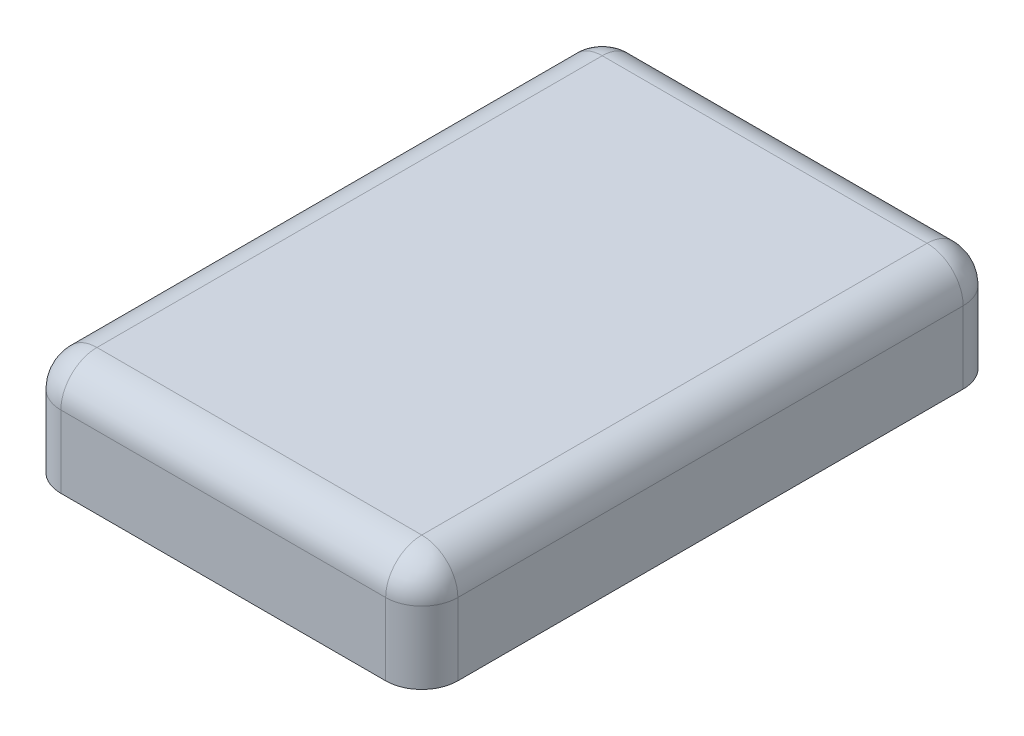
ISO-10303-21;
HEADER;
FILE_DESCRIPTION(('STEP AP214'),'2;1');
FILE_NAME('part.step','',(''),(''),'','','');
FILE_SCHEMA(('AUTOMOTIVE_DESIGN { 1 0 10303 214 1 1 1 1 }'));
ENDSEC;
DATA;
#1=APPLICATION_CONTEXT('core data for automotive mechanical design processes');
#2=APPLICATION_PROTOCOL_DEFINITION('international standard','automotive_design',2000,#1);
#3=PRODUCT_CONTEXT('',#1,'mechanical');
#4=PRODUCT('Part','Part','',(#3));
#5=PRODUCT_RELATED_PRODUCT_CATEGORY('part','',(#4));
#6=PRODUCT_DEFINITION_FORMATION('','',#4);
#7=PRODUCT_DEFINITION_CONTEXT('part definition',#1,'design');
#8=PRODUCT_DEFINITION('design','',#6,#7);
#9=PRODUCT_DEFINITION_SHAPE('','',#8);
#10=(LENGTH_UNIT() NAMED_UNIT(*) SI_UNIT(.MILLI.,.METRE.));
#11=(NAMED_UNIT(*) PLANE_ANGLE_UNIT() SI_UNIT($,.RADIAN.));
#12=(NAMED_UNIT(*) SI_UNIT($,.STERADIAN.) SOLID_ANGLE_UNIT());
#13=UNCERTAINTY_MEASURE_WITH_UNIT(LENGTH_MEASURE(1.E-05),#10,'distance_accuracy_value','');
#14=(GEOMETRIC_REPRESENTATION_CONTEXT(3) GLOBAL_UNCERTAINTY_ASSIGNED_CONTEXT((#13)) GLOBAL_UNIT_ASSIGNED_CONTEXT((#10,
#11,#12)) REPRESENTATION_CONTEXT('',''));
#15=CARTESIAN_POINT('',(0.,0.,0.));
#16=DIRECTION('',(0.,0.,1.));
#17=DIRECTION('',(1.,0.,0.));
#18=AXIS2_PLACEMENT_3D('',#15,#16,#17);
#19=CARTESIAN_POINT('',(1.1,0.6,-1.6));
#20=DIRECTION('',(-1.,0.,0.));
#21=DIRECTION('',(0.,0.,1.));
#22=AXIS2_PLACEMENT_3D('',#19,#20,#21);
#23=PLANE('',#22);
#24=DIRECTION('',(0.,-1.,0.));
#25=VECTOR('',#24,1.);
#26=CARTESIAN_POINT('',(1.1,0.6,-1.4));
#27=LINE('',#26,#25);
#28=CARTESIAN_POINT('',(1.1,0.,-1.4));
#29=VERTEX_POINT('',#28);
#30=CARTESIAN_POINT('',(1.1,0.4,-1.4));
#31=VERTEX_POINT('',#30);
#32=EDGE_CURVE('E122',#29,#31,#27,.F.);
#33=ORIENTED_EDGE('',*,*,#32,.T.);
#34=DIRECTION('',(0.,0.,-1.));
#35=VECTOR('',#34,1.);
#36=CARTESIAN_POINT('',(1.1,0.4,1.4));
#37=LINE('',#36,#35);
#38=CARTESIAN_POINT('',(1.1,0.4,1.4));
#39=VERTEX_POINT('',#38);
#40=EDGE_CURVE('E62',#31,#39,#37,.F.);
#41=ORIENTED_EDGE('',*,*,#40,.T.);
#42=DIRECTION('',(0.,-1.,0.));
#43=VECTOR('',#42,1.);
#44=CARTESIAN_POINT('',(1.1,0.6,1.4));
#45=LINE('',#44,#43);
#46=CARTESIAN_POINT('',(1.1,0.,1.4));
#47=VERTEX_POINT('',#46);
#48=EDGE_CURVE('E115',#39,#47,#45,.T.);
#49=ORIENTED_EDGE('',*,*,#48,.T.);
#50=DIRECTION('',(0.,0.,-1.));
#51=VECTOR('',#50,1.);
#52=CARTESIAN_POINT('',(1.1,0.,-1.6));
#53=LINE('',#52,#51);
#54=EDGE_CURVE('E118',#47,#29,#53,.T.);
#55=ORIENTED_EDGE('',*,*,#54,.T.);
#56=EDGE_LOOP('',(#33,#41,#49,#55));
#57=FACE_BOUND('',#56,.T.);
#58=ADVANCED_FACE('F38',(#57),#23,.F.);
#59=CARTESIAN_POINT('',(-1.1,0.6,-1.6));
#60=DIRECTION('',(0.,0.,1.));
#61=DIRECTION('',(1.,0.,0.));
#62=AXIS2_PLACEMENT_3D('',#59,#60,#61);
#63=PLANE('',#62);
#64=DIRECTION('',(0.,-1.,0.));
#65=VECTOR('',#64,1.);
#66=CARTESIAN_POINT('',(-0.9,0.6,-1.6));
#67=LINE('',#66,#65);
#68=CARTESIAN_POINT('',(-0.9,0.,-1.6));
#69=VERTEX_POINT('',#68);
#70=CARTESIAN_POINT('',(-0.9,0.4,-1.6));
#71=VERTEX_POINT('',#70);
#72=EDGE_CURVE('E155',#69,#71,#67,.F.);
#73=ORIENTED_EDGE('',*,*,#72,.T.);
#74=DIRECTION('',(-1.,0.,0.));
#75=VECTOR('',#74,1.);
#76=CARTESIAN_POINT('',(0.9,0.4,-1.6));
#77=LINE('',#76,#75);
#78=CARTESIAN_POINT('',(0.9,0.4,-1.6));
#79=VERTEX_POINT('',#78);
#80=EDGE_CURVE('E181',#71,#79,#77,.F.);
#81=ORIENTED_EDGE('',*,*,#80,.T.);
#82=DIRECTION('',(0.,-1.,0.));
#83=VECTOR('',#82,1.);
#84=CARTESIAN_POINT('',(0.9,0.6,-1.6));
#85=LINE('',#84,#83);
#86=CARTESIAN_POINT('',(0.9,0.,-1.6));
#87=VERTEX_POINT('',#86);
#88=EDGE_CURVE('E158',#79,#87,#85,.T.);
#89=ORIENTED_EDGE('',*,*,#88,.T.);
#90=DIRECTION('',(-1.,0.,0.));
#91=VECTOR('',#90,1.);
#92=CARTESIAN_POINT('',(-1.1,0.,-1.6));
#93=LINE('',#92,#91);
#94=EDGE_CURVE('E136',#87,#69,#93,.T.);
#95=ORIENTED_EDGE('',*,*,#94,.T.);
#96=EDGE_LOOP('',(#73,#81,#89,#95));
#97=FACE_BOUND('',#96,.T.);
#98=ADVANCED_FACE('F240',(#97),#63,.F.);
#99=CARTESIAN_POINT('',(-1.1,0.6,-1.6));
#100=DIRECTION('',(1.,0.,0.));
#101=DIRECTION('',(0.,0.,-1.));
#102=AXIS2_PLACEMENT_3D('',#99,#100,#101);
#103=PLANE('',#102);
#104=DIRECTION('',(0.,-1.,0.));
#105=VECTOR('',#104,1.);
#106=CARTESIAN_POINT('',(-1.1,0.6,1.4));
#107=LINE('',#106,#105);
#108=CARTESIAN_POINT('',(-1.1,0.,1.4));
#109=VERTEX_POINT('',#108);
#110=CARTESIAN_POINT('',(-1.1,0.4,1.4));
#111=VERTEX_POINT('',#110);
#112=EDGE_CURVE('E162',#109,#111,#107,.F.);
#113=ORIENTED_EDGE('',*,*,#112,.T.);
#114=DIRECTION('',(0.,0.,1.));
#115=VECTOR('',#114,1.);
#116=CARTESIAN_POINT('',(-1.1,0.4,-1.4));
#117=LINE('',#116,#115);
#118=CARTESIAN_POINT('',(-1.1,0.4,-1.4));
#119=VERTEX_POINT('',#118);
#120=EDGE_CURVE('E177',#111,#119,#117,.F.);
#121=ORIENTED_EDGE('',*,*,#120,.T.);
#122=DIRECTION('',(0.,-1.,0.));
#123=VECTOR('',#122,1.);
#124=CARTESIAN_POINT('',(-1.1,0.6,-1.4));
#125=LINE('',#124,#123);
#126=CARTESIAN_POINT('',(-1.1,0.,-1.4));
#127=VERTEX_POINT('',#126);
#128=EDGE_CURVE('E160',#119,#127,#125,.T.);
#129=ORIENTED_EDGE('',*,*,#128,.T.);
#130=DIRECTION('',(0.,0.,1.));
#131=VECTOR('',#130,1.);
#132=CARTESIAN_POINT('',(-1.1,0.,-1.6));
#133=LINE('',#132,#131);
#134=EDGE_CURVE('E139',#127,#109,#133,.T.);
#135=ORIENTED_EDGE('',*,*,#134,.T.);
#136=EDGE_LOOP('',(#113,#121,#129,#135));
#137=FACE_BOUND('',#136,.T.);
#138=ADVANCED_FACE('F245',(#137),#103,.F.);
#139=CARTESIAN_POINT('',(-1.1,0.6,1.6));
#140=DIRECTION('',(0.,0.,-1.));
#141=DIRECTION('',(-1.,0.,0.));
#142=AXIS2_PLACEMENT_3D('',#139,#140,#141);
#143=PLANE('',#142);
#144=DIRECTION('',(0.,-1.,0.));
#145=VECTOR('',#144,1.);
#146=CARTESIAN_POINT('',(0.9,0.6,1.6));
#147=LINE('',#146,#145);
#148=CARTESIAN_POINT('',(0.9,0.,1.6));
#149=VERTEX_POINT('',#148);
#150=CARTESIAN_POINT('',(0.9,0.4,1.6));
#151=VERTEX_POINT('',#150);
#152=EDGE_CURVE('E126',#149,#151,#147,.F.);
#153=ORIENTED_EDGE('',*,*,#152,.T.);
#154=DIRECTION('',(1.,0.,0.));
#155=VECTOR('',#154,1.);
#156=CARTESIAN_POINT('',(-0.9,0.4,1.6));
#157=LINE('',#156,#155);
#158=CARTESIAN_POINT('',(-0.9,0.4,1.6));
#159=VERTEX_POINT('',#158);
#160=EDGE_CURVE('E11',#151,#159,#157,.F.);
#161=ORIENTED_EDGE('',*,*,#160,.T.);
#162=DIRECTION('',(0.,-1.,0.));
#163=VECTOR('',#162,1.);
#164=CARTESIAN_POINT('',(-0.9,0.6,1.6));
#165=LINE('',#164,#163);
#166=CARTESIAN_POINT('',(-0.9,0.,1.6));
#167=VERTEX_POINT('',#166);
#168=EDGE_CURVE('E130',#159,#167,#165,.T.);
#169=ORIENTED_EDGE('',*,*,#168,.T.);
#170=DIRECTION('',(1.,0.,0.));
#171=VECTOR('',#170,1.);
#172=CARTESIAN_POINT('',(-1.1,0.,1.6));
#173=LINE('',#172,#171);
#174=EDGE_CURVE('E146',#167,#149,#173,.T.);
#175=ORIENTED_EDGE('',*,*,#174,.T.);
#176=EDGE_LOOP('',(#153,#161,#169,#175));
#177=FACE_BOUND('',#176,.T.);
#178=ADVANCED_FACE('F356',(#177),#143,.F.);
#179=CARTESIAN_POINT('',(0.,0.6,0.));
#180=DIRECTION('',(0.,1.,0.));
#181=DIRECTION('',(0.,0.,1.));
#182=AXIS2_PLACEMENT_3D('',#179,#180,#181);
#183=PLANE('',#182);
#184=DIRECTION('',(-1.,0.,0.));
#185=VECTOR('',#184,1.);
#186=CARTESIAN_POINT('',(-0.9,0.6,-1.4));
#187=LINE('',#186,#185);
#188=CARTESIAN_POINT('',(0.9,0.6,-1.4));
#189=VERTEX_POINT('',#188);
#190=CARTESIAN_POINT('',(-0.9,0.6,-1.4));
#191=VERTEX_POINT('',#190);
#192=EDGE_CURVE('E172',#189,#191,#187,.T.);
#193=ORIENTED_EDGE('',*,*,#192,.T.);
#194=DIRECTION('',(0.,0.,1.));
#195=VECTOR('',#194,1.);
#196=CARTESIAN_POINT('',(-0.9,0.6,1.4));
#197=LINE('',#196,#195);
#198=CARTESIAN_POINT('',(-0.9,0.6,1.4));
#199=VERTEX_POINT('',#198);
#200=EDGE_CURVE('E174',#191,#199,#197,.T.);
#201=ORIENTED_EDGE('',*,*,#200,.T.);
#202=DIRECTION('',(1.,0.,0.));
#203=VECTOR('',#202,1.);
#204=CARTESIAN_POINT('',(0.9,0.6,1.4));
#205=LINE('',#204,#203);
#206=CARTESIAN_POINT('',(0.9,0.6,1.4));
#207=VERTEX_POINT('',#206);
#208=EDGE_CURVE('E168',#199,#207,#205,.T.);
#209=ORIENTED_EDGE('',*,*,#208,.T.);
#210=DIRECTION('',(0.,0.,-1.));
#211=VECTOR('',#210,1.);
#212=CARTESIAN_POINT('',(0.9,0.6,-1.4));
#213=LINE('',#212,#211);
#214=EDGE_CURVE('E170',#207,#189,#213,.T.);
#215=ORIENTED_EDGE('',*,*,#214,.T.);
#216=EDGE_LOOP('',(#193,#201,#209,#215));
#217=FACE_BOUND('',#216,.T.);
#218=ADVANCED_FACE('F217',(#217),#183,.T.);
#219=CARTESIAN_POINT('',(0.,0.,0.));
#220=DIRECTION('',(0.,1.,0.));
#221=DIRECTION('',(0.,0.,1.));
#222=AXIS2_PLACEMENT_3D('',#219,#220,#221);
#223=PLANE('',#222);
#224=ORIENTED_EDGE('',*,*,#54,.F.);
#225=CARTESIAN_POINT('',(0.9,0.,1.4));
#226=DIRECTION('',(0.,1.,0.));
#227=DIRECTION('',(0.,0.,1.));
#228=AXIS2_PLACEMENT_3D('',#225,#226,#227);
#229=CIRCLE('',#228,0.2);
#230=EDGE_CURVE('E124',#47,#149,#229,.F.);
#231=ORIENTED_EDGE('',*,*,#230,.T.);
#232=ORIENTED_EDGE('',*,*,#174,.F.);
#233=CARTESIAN_POINT('',(-0.9,0.,1.4));
#234=DIRECTION('',(0.,1.,0.));
#235=DIRECTION('',(0.,0.,1.));
#236=AXIS2_PLACEMENT_3D('',#233,#234,#235);
#237=CIRCLE('',#236,0.2);
#238=EDGE_CURVE('E150',#167,#109,#237,.F.);
#239=ORIENTED_EDGE('',*,*,#238,.T.);
#240=ORIENTED_EDGE('',*,*,#134,.F.);
#241=CARTESIAN_POINT('',(-0.9,0.,-1.4));
#242=DIRECTION('',(0.,1.,0.));
#243=DIRECTION('',(0.,0.,1.));
#244=AXIS2_PLACEMENT_3D('',#241,#242,#243);
#245=CIRCLE('',#244,0.2);
#246=EDGE_CURVE('E121',#127,#69,#245,.F.);
#247=ORIENTED_EDGE('',*,*,#246,.T.);
#248=ORIENTED_EDGE('',*,*,#94,.F.);
#249=CARTESIAN_POINT('',(0.9,0.,-1.4));
#250=DIRECTION('',(0.,1.,0.));
#251=DIRECTION('',(0.,0.,1.));
#252=AXIS2_PLACEMENT_3D('',#249,#250,#251);
#253=CIRCLE('',#252,0.2);
#254=EDGE_CURVE('E131',#87,#29,#253,.F.);
#255=ORIENTED_EDGE('',*,*,#254,.T.);
#256=EDGE_LOOP('',(#224,#231,#232,#239,#240,#247,#248,#255));
#257=FACE_BOUND('',#256,.T.);
#258=ADVANCED_FACE('F133',(#257),#223,.F.);
#259=CARTESIAN_POINT('',(0.9,0.6,1.4));
#260=DIRECTION('',(0.,-1.,0.));
#261=DIRECTION('',(0.,0.,-1.));
#262=AXIS2_PLACEMENT_3D('',#259,#260,#261);
#263=CYLINDRICAL_SURFACE('',#262,0.2);
#264=ORIENTED_EDGE('',*,*,#48,.F.);
#265=CARTESIAN_POINT('',(0.9,0.4,1.4));
#266=DIRECTION('',(0.,-1.,0.));
#267=DIRECTION('',(0.,0.,-1.));
#268=AXIS2_PLACEMENT_3D('',#265,#266,#267);
#269=CIRCLE('',#268,0.2);
#270=EDGE_CURVE('E47',#39,#151,#269,.T.);
#271=ORIENTED_EDGE('',*,*,#270,.T.);
#272=ORIENTED_EDGE('',*,*,#152,.F.);
#273=ORIENTED_EDGE('',*,*,#230,.F.);
#274=EDGE_LOOP('',(#264,#271,#272,#273));
#275=FACE_BOUND('',#274,.T.);
#276=ADVANCED_FACE('F125',(#275),#263,.T.);
#277=CARTESIAN_POINT('',(0.9,0.6,-1.4));
#278=DIRECTION('',(0.,-1.,0.));
#279=DIRECTION('',(0.,0.,-1.));
#280=AXIS2_PLACEMENT_3D('',#277,#278,#279);
#281=CYLINDRICAL_SURFACE('',#280,0.2);
#282=ORIENTED_EDGE('',*,*,#88,.F.);
#283=CARTESIAN_POINT('',(0.9,0.4,-1.4));
#284=DIRECTION('',(0.,-1.,0.));
#285=DIRECTION('',(0.,0.,-1.));
#286=AXIS2_PLACEMENT_3D('',#283,#284,#285);
#287=CIRCLE('',#286,0.2);
#288=EDGE_CURVE('E183',#79,#31,#287,.T.);
#289=ORIENTED_EDGE('',*,*,#288,.T.);
#290=ORIENTED_EDGE('',*,*,#32,.F.);
#291=ORIENTED_EDGE('',*,*,#254,.F.);
#292=EDGE_LOOP('',(#282,#289,#290,#291));
#293=FACE_BOUND('',#292,.T.);
#294=ADVANCED_FACE('F252',(#293),#281,.T.);
#295=CARTESIAN_POINT('',(-0.9,0.6,1.4));
#296=DIRECTION('',(0.,-1.,0.));
#297=DIRECTION('',(0.,0.,-1.));
#298=AXIS2_PLACEMENT_3D('',#295,#296,#297);
#299=CYLINDRICAL_SURFACE('',#298,0.2);
#300=ORIENTED_EDGE('',*,*,#168,.F.);
#301=CARTESIAN_POINT('',(-0.9,0.4,1.4));
#302=DIRECTION('',(0.,-1.,0.));
#303=DIRECTION('',(0.,0.,-1.));
#304=AXIS2_PLACEMENT_3D('',#301,#302,#303);
#305=CIRCLE('',#304,0.2);
#306=EDGE_CURVE('E165',#159,#111,#305,.T.);
#307=ORIENTED_EDGE('',*,*,#306,.T.);
#308=ORIENTED_EDGE('',*,*,#112,.F.);
#309=ORIENTED_EDGE('',*,*,#238,.F.);
#310=EDGE_LOOP('',(#300,#307,#308,#309));
#311=FACE_BOUND('',#310,.T.);
#312=ADVANCED_FACE('F255',(#311),#299,.T.);
#313=CARTESIAN_POINT('',(-0.9,0.6,-1.4));
#314=DIRECTION('',(0.,-1.,0.));
#315=DIRECTION('',(0.,0.,-1.));
#316=AXIS2_PLACEMENT_3D('',#313,#314,#315);
#317=CYLINDRICAL_SURFACE('',#316,0.2);
#318=ORIENTED_EDGE('',*,*,#128,.F.);
#319=CARTESIAN_POINT('',(-0.9,0.4,-1.4));
#320=DIRECTION('',(0.,-1.,0.));
#321=DIRECTION('',(0.,0.,-1.));
#322=AXIS2_PLACEMENT_3D('',#319,#320,#321);
#323=CIRCLE('',#322,0.2);
#324=EDGE_CURVE('E179',#119,#71,#323,.T.);
#325=ORIENTED_EDGE('',*,*,#324,.T.);
#326=ORIENTED_EDGE('',*,*,#72,.F.);
#327=ORIENTED_EDGE('',*,*,#246,.F.);
#328=EDGE_LOOP('',(#318,#325,#326,#327));
#329=FACE_BOUND('',#328,.T.);
#330=ADVANCED_FACE('F259',(#329),#317,.T.);
#331=CARTESIAN_POINT('',(0.9,0.4,-1.4));
#332=DIRECTION('',(0.,1.,0.));
#333=DIRECTION('',(0.,0.,1.));
#334=AXIS2_PLACEMENT_3D('',#331,#332,#333);
#335=SPHERICAL_SURFACE('',#334,0.2);
#336=CARTESIAN_POINT('',(0.9,0.4,-1.4));
#337=DIRECTION('',(0.,0.,1.));
#338=DIRECTION('',(1.,0.,0.));
#339=AXIS2_PLACEMENT_3D('',#336,#337,#338);
#340=CIRCLE('',#339,0.2);
#341=EDGE_CURVE('E142',#31,#189,#340,.T.);
#342=ORIENTED_EDGE('',*,*,#341,.F.);
#343=ORIENTED_EDGE('',*,*,#288,.F.);
#344=CARTESIAN_POINT('',(0.9,0.4,-1.4));
#345=DIRECTION('',(-1.,0.,0.));
#346=DIRECTION('',(0.,0.,1.));
#347=AXIS2_PLACEMENT_3D('',#344,#345,#346);
#348=CIRCLE('',#347,0.2);
#349=EDGE_CURVE('E42',#189,#79,#348,.T.);
#350=ORIENTED_EDGE('',*,*,#349,.F.);
#351=EDGE_LOOP('',(#342,#343,#350));
#352=FACE_BOUND('',#351,.T.);
#353=ADVANCED_FACE('F40',(#352),#335,.T.);
#354=CARTESIAN_POINT('',(0.,0.4,-1.4));
#355=DIRECTION('',(1.,0.,0.));
#356=DIRECTION('',(0.,0.,-1.));
#357=AXIS2_PLACEMENT_3D('',#354,#355,#356);
#358=CYLINDRICAL_SURFACE('',#357,0.2);
#359=ORIENTED_EDGE('',*,*,#349,.T.);
#360=ORIENTED_EDGE('',*,*,#80,.F.);
#361=CARTESIAN_POINT('',(-0.9,0.4,-1.4));
#362=DIRECTION('',(-1.,0.,0.));
#363=DIRECTION('',(0.,0.,1.));
#364=AXIS2_PLACEMENT_3D('',#361,#362,#363);
#365=CIRCLE('',#364,0.2);
#366=EDGE_CURVE('E200',#191,#71,#365,.T.);
#367=ORIENTED_EDGE('',*,*,#366,.F.);
#368=ORIENTED_EDGE('',*,*,#192,.F.);
#369=EDGE_LOOP('',(#359,#360,#367,#368));
#370=FACE_BOUND('',#369,.T.);
#371=ADVANCED_FACE('F214',(#370),#358,.T.);
#372=CARTESIAN_POINT('',(0.9,0.4,0.));
#373=DIRECTION('',(0.,0.,1.));
#374=DIRECTION('',(1.,0.,0.));
#375=AXIS2_PLACEMENT_3D('',#372,#373,#374);
#376=CYLINDRICAL_SURFACE('',#375,0.2);
#377=ORIENTED_EDGE('',*,*,#341,.T.);
#378=ORIENTED_EDGE('',*,*,#214,.F.);
#379=CARTESIAN_POINT('',(0.9,0.4,1.4));
#380=DIRECTION('',(0.,0.,1.));
#381=DIRECTION('',(1.,0.,0.));
#382=AXIS2_PLACEMENT_3D('',#379,#380,#381);
#383=CIRCLE('',#382,0.2);
#384=EDGE_CURVE('E197',#39,#207,#383,.T.);
#385=ORIENTED_EDGE('',*,*,#384,.F.);
#386=ORIENTED_EDGE('',*,*,#40,.F.);
#387=EDGE_LOOP('',(#377,#378,#385,#386));
#388=FACE_BOUND('',#387,.T.);
#389=ADVANCED_FACE('F207',(#388),#376,.T.);
#390=CARTESIAN_POINT('',(-0.9,0.4,-1.4));
#391=DIRECTION('',(0.,1.,0.));
#392=DIRECTION('',(0.,0.,1.));
#393=AXIS2_PLACEMENT_3D('',#390,#391,#392);
#394=SPHERICAL_SURFACE('',#393,0.2);
#395=ORIENTED_EDGE('',*,*,#366,.T.);
#396=ORIENTED_EDGE('',*,*,#324,.F.);
#397=CARTESIAN_POINT('',(-0.9,0.4,-1.4));
#398=DIRECTION('',(0.,0.,1.));
#399=DIRECTION('',(1.,0.,0.));
#400=AXIS2_PLACEMENT_3D('',#397,#398,#399);
#401=CIRCLE('',#400,0.2);
#402=EDGE_CURVE('E194',#191,#119,#401,.T.);
#403=ORIENTED_EDGE('',*,*,#402,.F.);
#404=EDGE_LOOP('',(#395,#396,#403));
#405=FACE_BOUND('',#404,.T.);
#406=ADVANCED_FACE('F229',(#405),#394,.T.);
#407=CARTESIAN_POINT('',(0.9,0.4,1.4));
#408=DIRECTION('',(0.,1.,0.));
#409=DIRECTION('',(0.,0.,1.));
#410=AXIS2_PLACEMENT_3D('',#407,#408,#409);
#411=SPHERICAL_SURFACE('',#410,0.2);
#412=ORIENTED_EDGE('',*,*,#270,.F.);
#413=ORIENTED_EDGE('',*,*,#384,.T.);
#414=CARTESIAN_POINT('',(0.9,0.4,1.4));
#415=DIRECTION('',(-1.,0.,0.));
#416=DIRECTION('',(0.,0.,1.));
#417=AXIS2_PLACEMENT_3D('',#414,#415,#416);
#418=CIRCLE('',#417,0.2);
#419=EDGE_CURVE('E191',#151,#207,#418,.T.);
#420=ORIENTED_EDGE('',*,*,#419,.F.);
#421=EDGE_LOOP('',(#412,#413,#420));
#422=FACE_BOUND('',#421,.T.);
#423=ADVANCED_FACE('F226',(#422),#411,.T.);
#424=CARTESIAN_POINT('',(-0.9,0.4,0.));
#425=DIRECTION('',(0.,0.,-1.));
#426=DIRECTION('',(-1.,0.,0.));
#427=AXIS2_PLACEMENT_3D('',#424,#425,#426);
#428=CYLINDRICAL_SURFACE('',#427,0.2);
#429=ORIENTED_EDGE('',*,*,#402,.T.);
#430=ORIENTED_EDGE('',*,*,#120,.F.);
#431=CARTESIAN_POINT('',(-0.9,0.4,1.4));
#432=DIRECTION('',(0.,0.,1.));
#433=DIRECTION('',(1.,0.,0.));
#434=AXIS2_PLACEMENT_3D('',#431,#432,#433);
#435=CIRCLE('',#434,0.2);
#436=EDGE_CURVE('E189',#199,#111,#435,.T.);
#437=ORIENTED_EDGE('',*,*,#436,.F.);
#438=ORIENTED_EDGE('',*,*,#200,.F.);
#439=EDGE_LOOP('',(#429,#430,#437,#438));
#440=FACE_BOUND('',#439,.T.);
#441=ADVANCED_FACE('F228',(#440),#428,.T.);
#442=CARTESIAN_POINT('',(0.,0.4,1.4));
#443=DIRECTION('',(-1.,0.,0.));
#444=DIRECTION('',(0.,0.,1.));
#445=AXIS2_PLACEMENT_3D('',#442,#443,#444);
#446=CYLINDRICAL_SURFACE('',#445,0.2);
#447=ORIENTED_EDGE('',*,*,#419,.T.);
#448=ORIENTED_EDGE('',*,*,#208,.F.);
#449=CARTESIAN_POINT('',(-0.9,0.4,1.4));
#450=DIRECTION('',(-1.,0.,0.));
#451=DIRECTION('',(0.,0.,1.));
#452=AXIS2_PLACEMENT_3D('',#449,#450,#451);
#453=CIRCLE('',#452,0.2);
#454=EDGE_CURVE('E187',#159,#199,#453,.T.);
#455=ORIENTED_EDGE('',*,*,#454,.F.);
#456=ORIENTED_EDGE('',*,*,#160,.F.);
#457=EDGE_LOOP('',(#447,#448,#455,#456));
#458=FACE_BOUND('',#457,.T.);
#459=ADVANCED_FACE('F222',(#458),#446,.T.);
#460=CARTESIAN_POINT('',(-0.9,0.4,1.4));
#461=DIRECTION('',(0.,1.,0.));
#462=DIRECTION('',(0.,0.,1.));
#463=AXIS2_PLACEMENT_3D('',#460,#461,#462);
#464=SPHERICAL_SURFACE('',#463,0.2);
#465=ORIENTED_EDGE('',*,*,#436,.T.);
#466=ORIENTED_EDGE('',*,*,#306,.F.);
#467=ORIENTED_EDGE('',*,*,#454,.T.);
#468=EDGE_LOOP('',(#465,#466,#467));
#469=FACE_BOUND('',#468,.T.);
#470=ADVANCED_FACE('F264',(#469),#464,.T.);
#471=CLOSED_SHELL('',(#58,#98,#138,#178,#218,#258,#276,#294,#312,#330,#353,#371,#389,#406,#423,
#441,#459,#470));
#472=MANIFOLD_SOLID_BREP('B2',#471);
#473=ADVANCED_BREP_SHAPE_REPRESENTATION('',(#18,#472),#14);
#474=SHAPE_DEFINITION_REPRESENTATION(#9,#473);
ENDSEC;
END-ISO-10303-21;
